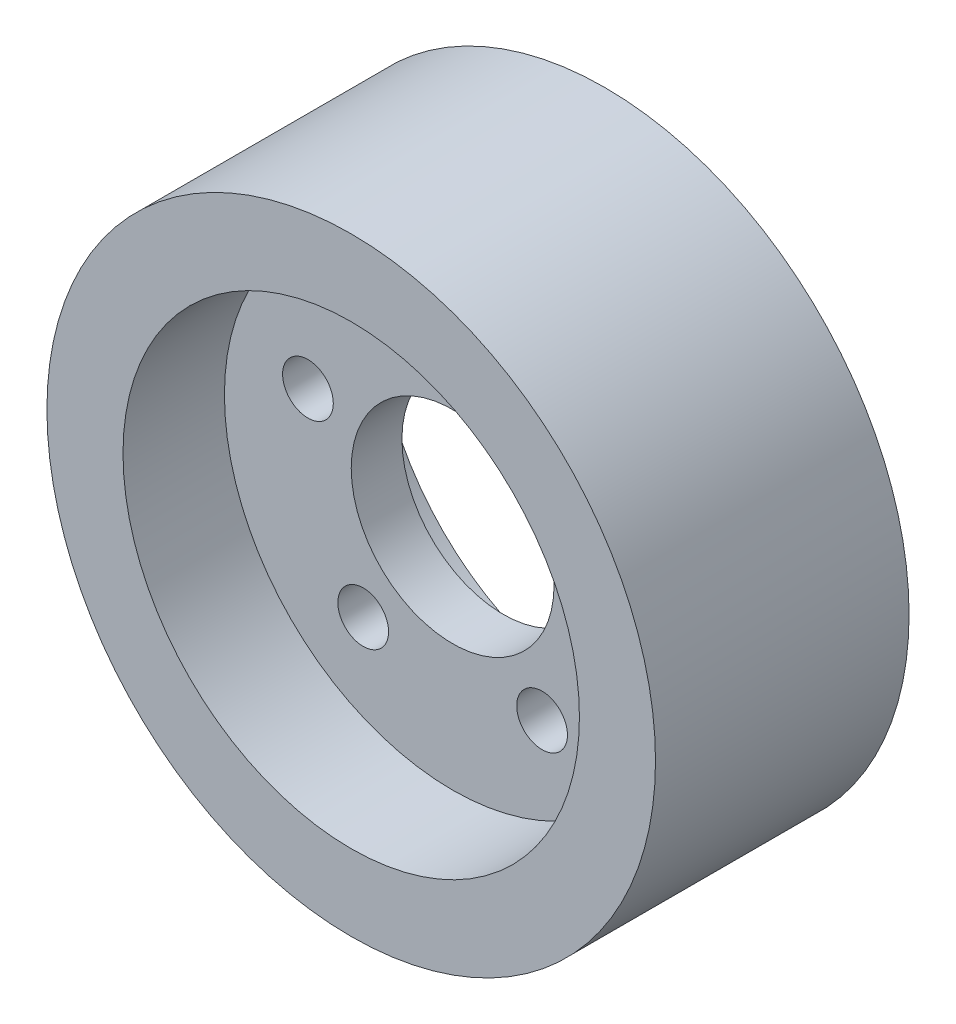
ISO-10303-21;
HEADER;
FILE_DESCRIPTION(('STEP AP214'),'2;1');
FILE_NAME('part.step','',(''),(''),'','','');
FILE_SCHEMA(('AUTOMOTIVE_DESIGN { 1 0 10303 214 1 1 1 1 }'));
ENDSEC;
DATA;
#1=APPLICATION_CONTEXT('core data for automotive mechanical design processes');
#2=APPLICATION_PROTOCOL_DEFINITION('international standard','automotive_design',2000,#1);
#3=PRODUCT_CONTEXT('',#1,'mechanical');
#4=PRODUCT('Part','Part','',(#3));
#5=PRODUCT_RELATED_PRODUCT_CATEGORY('part','',(#4));
#6=PRODUCT_DEFINITION_FORMATION('','',#4);
#7=PRODUCT_DEFINITION_CONTEXT('part definition',#1,'design');
#8=PRODUCT_DEFINITION('design','',#6,#7);
#9=PRODUCT_DEFINITION_SHAPE('','',#8);
#10=(LENGTH_UNIT() NAMED_UNIT(*) SI_UNIT(.MILLI.,.METRE.));
#11=(NAMED_UNIT(*) PLANE_ANGLE_UNIT() SI_UNIT($,.RADIAN.));
#12=(NAMED_UNIT(*) SI_UNIT($,.STERADIAN.) SOLID_ANGLE_UNIT());
#13=UNCERTAINTY_MEASURE_WITH_UNIT(LENGTH_MEASURE(1.E-05),#10,'distance_accuracy_value','');
#14=(GEOMETRIC_REPRESENTATION_CONTEXT(3) GLOBAL_UNCERTAINTY_ASSIGNED_CONTEXT((#13)) GLOBAL_UNIT_ASSIGNED_CONTEXT((#10,
#11,#12)) REPRESENTATION_CONTEXT('',''));
#15=CARTESIAN_POINT('',(0.,0.,0.));
#16=DIRECTION('',(0.,0.,1.));
#17=DIRECTION('',(1.,0.,0.));
#18=AXIS2_PLACEMENT_3D('',#15,#16,#17);
#19=CARTESIAN_POINT('',(0.,0.,12.5));
#20=DIRECTION('',(0.,0.,-1.));
#21=DIRECTION('',(-1.,0.,0.));
#22=AXIS2_PLACEMENT_3D('',#19,#20,#21);
#23=CYLINDRICAL_SURFACE('',#22,10.);
#24=CARTESIAN_POINT('',(0.,0.,-2.5));
#25=DIRECTION('',(0.,0.,-1.));
#26=DIRECTION('',(-1.,0.,0.));
#27=AXIS2_PLACEMENT_3D('',#24,#25,#26);
#28=CIRCLE('',#27,10.);
#29=CARTESIAN_POINT('',(-10.,0.,-2.5));
#30=VERTEX_POINT('',#29);
#31=EDGE_CURVE('E44',#30,#30,#28,.T.);
#32=ORIENTED_EDGE('',*,*,#31,.T.);
#33=EDGE_LOOP('',(#32));
#34=FACE_BOUND('',#33,.T.);
#35=CARTESIAN_POINT('',(0.,0.,2.5));
#36=DIRECTION('',(0.,0.,1.));
#37=DIRECTION('',(1.,0.,0.));
#38=AXIS2_PLACEMENT_3D('',#35,#36,#37);
#39=CIRCLE('',#38,10.);
#40=CARTESIAN_POINT('',(10.,0.,2.5));
#41=VERTEX_POINT('',#40);
#42=EDGE_CURVE('E53',#41,#41,#39,.T.);
#43=ORIENTED_EDGE('',*,*,#42,.T.);
#44=EDGE_LOOP('',(#43));
#45=FACE_BOUND('',#44,.T.);
#46=ADVANCED_FACE('F31',(#34,#45),#23,.F.);
#47=CARTESIAN_POINT('',(0.,0.,12.5));
#48=DIRECTION('',(0.,0.,1.));
#49=DIRECTION('',(1.,0.,0.));
#50=AXIS2_PLACEMENT_3D('',#47,#48,#49);
#51=PLANE('',#50);
#52=CARTESIAN_POINT('',(0.,0.,12.5));
#53=DIRECTION('',(0.,0.,-1.));
#54=DIRECTION('',(-1.,0.,0.));
#55=AXIS2_PLACEMENT_3D('',#52,#53,#54);
#56=CIRCLE('',#55,22.5);
#57=CARTESIAN_POINT('',(-22.5,0.,12.5));
#58=VERTEX_POINT('',#57);
#59=EDGE_CURVE('E60',#58,#58,#56,.T.);
#60=ORIENTED_EDGE('',*,*,#59,.T.);
#61=EDGE_LOOP('',(#60));
#62=FACE_BOUND('',#61,.T.);
#63=CARTESIAN_POINT('',(0.,0.,12.5));
#64=DIRECTION('',(0.,0.,1.));
#65=DIRECTION('',(1.,0.,0.));
#66=AXIS2_PLACEMENT_3D('',#63,#64,#65);
#67=CIRCLE('',#66,30.);
#68=CARTESIAN_POINT('',(30.,0.,12.5));
#69=VERTEX_POINT('',#68);
#70=EDGE_CURVE('E10',#69,#69,#67,.T.);
#71=ORIENTED_EDGE('',*,*,#70,.T.);
#72=EDGE_LOOP('',(#71));
#73=FACE_BOUND('',#72,.T.);
#74=ADVANCED_FACE('F97',(#62,#73),#51,.T.);
#75=CARTESIAN_POINT('',(0.,0.,-12.5));
#76=DIRECTION('',(0.,0.,1.));
#77=DIRECTION('',(1.,0.,0.));
#78=AXIS2_PLACEMENT_3D('',#75,#76,#77);
#79=PLANE('',#78);
#80=CARTESIAN_POINT('',(0.,0.,-12.5));
#81=DIRECTION('',(0.,0.,-1.));
#82=DIRECTION('',(-1.,0.,0.));
#83=AXIS2_PLACEMENT_3D('',#80,#81,#82);
#84=CIRCLE('',#83,22.5);
#85=CARTESIAN_POINT('',(-22.5,0.,-12.5));
#86=VERTEX_POINT('',#85);
#87=EDGE_CURVE('E47',#86,#86,#84,.T.);
#88=ORIENTED_EDGE('',*,*,#87,.F.);
#89=EDGE_LOOP('',(#88));
#90=FACE_BOUND('',#89,.T.);
#91=CARTESIAN_POINT('',(0.,0.,-12.5));
#92=DIRECTION('',(0.,0.,1.));
#93=DIRECTION('',(1.,0.,0.));
#94=AXIS2_PLACEMENT_3D('',#91,#92,#93);
#95=CIRCLE('',#94,30.);
#96=CARTESIAN_POINT('',(30.,0.,-12.5));
#97=VERTEX_POINT('',#96);
#98=EDGE_CURVE('E39',#97,#97,#95,.T.);
#99=ORIENTED_EDGE('',*,*,#98,.F.);
#100=EDGE_LOOP('',(#99));
#101=FACE_BOUND('',#100,.T.);
#102=ADVANCED_FACE('F94',(#90,#101),#79,.F.);
#103=CARTESIAN_POINT('',(0.,0.,12.5));
#104=DIRECTION('',(0.,0.,-1.));
#105=DIRECTION('',(-1.,0.,0.));
#106=AXIS2_PLACEMENT_3D('',#103,#104,#105);
#107=CYLINDRICAL_SURFACE('',#106,30.);
#108=ORIENTED_EDGE('',*,*,#70,.F.);
#109=EDGE_LOOP('',(#108));
#110=FACE_BOUND('',#109,.T.);
#111=ORIENTED_EDGE('',*,*,#98,.T.);
#112=EDGE_LOOP('',(#111));
#113=FACE_BOUND('',#112,.T.);
#114=ADVANCED_FACE('F33',(#110,#113),#107,.T.);
#115=CARTESIAN_POINT('',(0.,0.,-2.5));
#116=DIRECTION('',(0.,0.,-1.));
#117=DIRECTION('',(-1.,0.,0.));
#118=AXIS2_PLACEMENT_3D('',#115,#116,#117);
#119=CYLINDRICAL_SURFACE('',#118,22.5);
#120=CARTESIAN_POINT('',(0.,0.,-2.5));
#121=DIRECTION('',(0.,0.,-1.));
#122=DIRECTION('',(-1.,0.,0.));
#123=AXIS2_PLACEMENT_3D('',#120,#121,#122);
#124=CIRCLE('',#123,22.5);
#125=CARTESIAN_POINT('',(-22.5,0.,-2.5));
#126=VERTEX_POINT('',#125);
#127=EDGE_CURVE('E52',#126,#126,#124,.T.);
#128=ORIENTED_EDGE('',*,*,#127,.F.);
#129=EDGE_LOOP('',(#128));
#130=FACE_BOUND('',#129,.T.);
#131=ORIENTED_EDGE('',*,*,#87,.T.);
#132=EDGE_LOOP('',(#131));
#133=FACE_BOUND('',#132,.T.);
#134=ADVANCED_FACE('F92',(#130,#133),#119,.F.);
#135=CARTESIAN_POINT('',(0.,0.,-2.5));
#136=DIRECTION('',(0.,0.,-1.));
#137=DIRECTION('',(-1.,0.,0.));
#138=AXIS2_PLACEMENT_3D('',#135,#136,#137);
#139=PLANE('',#138);
#140=CARTESIAN_POINT('',(-14.2658477444273,4.63525491562417,-2.5));
#141=DIRECTION('',(0.,0.,-1.));
#142=DIRECTION('',(-0.309016994374945,-0.951056516295155,0.));
#143=AXIS2_PLACEMENT_3D('',#140,#141,#142);
#144=CIRCLE('',#143,2.5);
#145=CARTESIAN_POINT('',(-15.0383902303647,2.25761362488628,-2.5));
#146=VERTEX_POINT('',#145);
#147=EDGE_CURVE('E66',#146,#146,#144,.T.);
#148=ORIENTED_EDGE('',*,*,#147,.F.);
#149=EDGE_LOOP('',(#148));
#150=FACE_BOUND('',#149,.T.);
#151=CARTESIAN_POINT('',(-8.81677878438703,-12.1352549156243,-2.5));
#152=DIRECTION('',(0.,0.,-1.));
#153=DIRECTION('',(0.809016994374951,-0.587785252292469,0.));
#154=AXIS2_PLACEMENT_3D('',#151,#152,#153);
#155=CIRCLE('',#154,2.5);
#156=CARTESIAN_POINT('',(-6.79423629844965,-13.6047180463554,-2.5));
#157=VERTEX_POINT('',#156);
#158=EDGE_CURVE('E151',#157,#157,#155,.T.);
#159=ORIENTED_EDGE('',*,*,#158,.F.);
#160=EDGE_LOOP('',(#159));
#161=FACE_BOUND('',#160,.T.);
#162=CARTESIAN_POINT('',(8.8167787843872,-12.1352549156241,-2.5));
#163=DIRECTION('',(0.,0.,-1.));
#164=DIRECTION('',(0.809016994374942,0.58778525229248,0.));
#165=AXIS2_PLACEMENT_3D('',#162,#163,#164);
#166=CIRCLE('',#165,2.5);
#167=CARTESIAN_POINT('',(10.8393212703246,-10.6657917848929,-2.5));
#168=VERTEX_POINT('',#167);
#169=EDGE_CURVE('E154',#168,#168,#166,.T.);
#170=ORIENTED_EDGE('',*,*,#169,.F.);
#171=EDGE_LOOP('',(#170));
#172=FACE_BOUND('',#171,.T.);
#173=CARTESIAN_POINT('',(14.2658477444273,4.63525491562437,-2.5));
#174=DIRECTION('',(0.,0.,-1.));
#175=DIRECTION('',(-0.309016994374958,0.95105651629515,0.));
#176=AXIS2_PLACEMENT_3D('',#173,#174,#175);
#177=CIRCLE('',#176,2.5);
#178=CARTESIAN_POINT('',(13.4933052584899,7.01289620636225,-2.5));
#179=VERTEX_POINT('',#178);
#180=EDGE_CURVE('E81',#179,#179,#177,.T.);
#181=ORIENTED_EDGE('',*,*,#180,.F.);
#182=EDGE_LOOP('',(#181));
#183=FACE_BOUND('',#182,.T.);
#184=CARTESIAN_POINT('',(0.,15.,-2.5));
#185=DIRECTION('',(0.,0.,-1.));
#186=DIRECTION('',(-1.,0.,0.));
#187=AXIS2_PLACEMENT_3D('',#184,#185,#186);
#188=CIRCLE('',#187,2.5);
#189=CARTESIAN_POINT('',(-2.5,15.,-2.5));
#190=VERTEX_POINT('',#189);
#191=EDGE_CURVE('E61',#190,#190,#188,.T.);
#192=ORIENTED_EDGE('',*,*,#191,.F.);
#193=EDGE_LOOP('',(#192));
#194=FACE_BOUND('',#193,.T.);
#195=ORIENTED_EDGE('',*,*,#31,.F.);
#196=EDGE_LOOP('',(#195));
#197=FACE_BOUND('',#196,.T.);
#198=ORIENTED_EDGE('',*,*,#127,.T.);
#199=EDGE_LOOP('',(#198));
#200=FACE_BOUND('',#199,.T.);
#201=ADVANCED_FACE('F105',(#150,#161,#172,#183,#194,#197,#200),#139,.T.);
#202=CARTESIAN_POINT('',(0.,0.,2.5));
#203=DIRECTION('',(0.,0.,1.));
#204=DIRECTION('',(1.,0.,0.));
#205=AXIS2_PLACEMENT_3D('',#202,#203,#204);
#206=CYLINDRICAL_SURFACE('',#205,22.5);
#207=CARTESIAN_POINT('',(0.,0.,2.5));
#208=DIRECTION('',(0.,0.,-1.));
#209=DIRECTION('',(-1.,0.,0.));
#210=AXIS2_PLACEMENT_3D('',#207,#208,#209);
#211=CIRCLE('',#210,22.5);
#212=CARTESIAN_POINT('',(-22.5,0.,2.5));
#213=VERTEX_POINT('',#212);
#214=EDGE_CURVE('E56',#213,#213,#211,.T.);
#215=ORIENTED_EDGE('',*,*,#214,.T.);
#216=EDGE_LOOP('',(#215));
#217=FACE_BOUND('',#216,.T.);
#218=ORIENTED_EDGE('',*,*,#59,.F.);
#219=EDGE_LOOP('',(#218));
#220=FACE_BOUND('',#219,.T.);
#221=ADVANCED_FACE('F120',(#217,#220),#206,.F.);
#222=CARTESIAN_POINT('',(0.,0.,2.5));
#223=DIRECTION('',(0.,0.,1.));
#224=DIRECTION('',(-1.,0.,0.));
#225=AXIS2_PLACEMENT_3D('',#222,#223,#224);
#226=PLANE('',#225);
#227=CARTESIAN_POINT('',(-14.2658477444273,4.63525491562417,2.5));
#228=DIRECTION('',(0.,0.,1.));
#229=DIRECTION('',(1.,0.,0.));
#230=AXIS2_PLACEMENT_3D('',#227,#228,#229);
#231=CIRCLE('',#230,2.5);
#232=CARTESIAN_POINT('',(-11.7658477444273,4.63525491562417,2.5));
#233=VERTEX_POINT('',#232);
#234=EDGE_CURVE('E35',#233,#233,#231,.T.);
#235=ORIENTED_EDGE('',*,*,#234,.F.);
#236=EDGE_LOOP('',(#235));
#237=FACE_BOUND('',#236,.T.);
#238=CARTESIAN_POINT('',(-8.81677878438703,-12.1352549156243,2.5));
#239=DIRECTION('',(0.,0.,1.));
#240=DIRECTION('',(1.,0.,0.));
#241=AXIS2_PLACEMENT_3D('',#238,#239,#240);
#242=CIRCLE('',#241,2.5);
#243=CARTESIAN_POINT('',(-6.31677878438703,-12.1352549156243,2.5));
#244=VERTEX_POINT('',#243);
#245=EDGE_CURVE('E68',#244,#244,#242,.T.);
#246=ORIENTED_EDGE('',*,*,#245,.F.);
#247=EDGE_LOOP('',(#246));
#248=FACE_BOUND('',#247,.T.);
#249=CARTESIAN_POINT('',(8.8167787843872,-12.1352549156241,2.5));
#250=DIRECTION('',(0.,0.,1.));
#251=DIRECTION('',(1.,0.,0.));
#252=AXIS2_PLACEMENT_3D('',#249,#250,#251);
#253=CIRCLE('',#252,2.5);
#254=CARTESIAN_POINT('',(11.3167787843872,-12.1352549156241,2.5));
#255=VERTEX_POINT('',#254);
#256=EDGE_CURVE('E65',#255,#255,#253,.T.);
#257=ORIENTED_EDGE('',*,*,#256,.F.);
#258=EDGE_LOOP('',(#257));
#259=FACE_BOUND('',#258,.T.);
#260=CARTESIAN_POINT('',(14.2658477444273,4.63525491562437,2.5));
#261=DIRECTION('',(0.,0.,1.));
#262=DIRECTION('',(1.,0.,0.));
#263=AXIS2_PLACEMENT_3D('',#260,#261,#262);
#264=CIRCLE('',#263,2.5);
#265=CARTESIAN_POINT('',(16.7658477444272,4.63525491562437,2.5));
#266=VERTEX_POINT('',#265);
#267=EDGE_CURVE('E62',#266,#266,#264,.T.);
#268=ORIENTED_EDGE('',*,*,#267,.F.);
#269=EDGE_LOOP('',(#268));
#270=FACE_BOUND('',#269,.T.);
#271=CARTESIAN_POINT('',(0.,15.,2.5));
#272=DIRECTION('',(0.,0.,1.));
#273=DIRECTION('',(1.,0.,0.));
#274=AXIS2_PLACEMENT_3D('',#271,#272,#273);
#275=CIRCLE('',#274,2.5);
#276=CARTESIAN_POINT('',(2.5,15.,2.5));
#277=VERTEX_POINT('',#276);
#278=EDGE_CURVE('E57',#277,#277,#275,.T.);
#279=ORIENTED_EDGE('',*,*,#278,.F.);
#280=EDGE_LOOP('',(#279));
#281=FACE_BOUND('',#280,.T.);
#282=ORIENTED_EDGE('',*,*,#42,.F.);
#283=EDGE_LOOP('',(#282));
#284=FACE_BOUND('',#283,.T.);
#285=ORIENTED_EDGE('',*,*,#214,.F.);
#286=EDGE_LOOP('',(#285));
#287=FACE_BOUND('',#286,.T.);
#288=ADVANCED_FACE('F124',(#237,#248,#259,#270,#281,#284,#287),#226,.T.);
#289=CARTESIAN_POINT('',(0.,15.,12.5));
#290=DIRECTION('',(0.,0.,-1.));
#291=DIRECTION('',(-1.,0.,0.));
#292=AXIS2_PLACEMENT_3D('',#289,#290,#291);
#293=CYLINDRICAL_SURFACE('',#292,2.5);
#294=ORIENTED_EDGE('',*,*,#278,.T.);
#295=EDGE_LOOP('',(#294));
#296=FACE_BOUND('',#295,.T.);
#297=ORIENTED_EDGE('',*,*,#191,.T.);
#298=EDGE_LOOP('',(#297));
#299=FACE_BOUND('',#298,.T.);
#300=ADVANCED_FACE('F128',(#296,#299),#293,.F.);
#301=CARTESIAN_POINT('',(14.2658477444273,4.63525491562437,12.5));
#302=DIRECTION('',(0.,0.,-1.));
#303=DIRECTION('',(-1.,0.,0.));
#304=AXIS2_PLACEMENT_3D('',#301,#302,#303);
#305=CYLINDRICAL_SURFACE('',#304,2.5);
#306=ORIENTED_EDGE('',*,*,#267,.T.);
#307=EDGE_LOOP('',(#306));
#308=FACE_BOUND('',#307,.T.);
#309=ORIENTED_EDGE('',*,*,#180,.T.);
#310=EDGE_LOOP('',(#309));
#311=FACE_BOUND('',#310,.T.);
#312=ADVANCED_FACE('F132',(#308,#311),#305,.F.);
#313=CARTESIAN_POINT('',(8.8167787843872,-12.1352549156241,12.5));
#314=DIRECTION('',(0.,0.,-1.));
#315=DIRECTION('',(-1.,0.,0.));
#316=AXIS2_PLACEMENT_3D('',#313,#314,#315);
#317=CYLINDRICAL_SURFACE('',#316,2.5);
#318=ORIENTED_EDGE('',*,*,#256,.T.);
#319=EDGE_LOOP('',(#318));
#320=FACE_BOUND('',#319,.T.);
#321=ORIENTED_EDGE('',*,*,#169,.T.);
#322=EDGE_LOOP('',(#321));
#323=FACE_BOUND('',#322,.T.);
#324=ADVANCED_FACE('F136',(#320,#323),#317,.F.);
#325=CARTESIAN_POINT('',(-8.81677878438703,-12.1352549156243,12.5));
#326=DIRECTION('',(0.,0.,-1.));
#327=DIRECTION('',(-1.,0.,0.));
#328=AXIS2_PLACEMENT_3D('',#325,#326,#327);
#329=CYLINDRICAL_SURFACE('',#328,2.5);
#330=ORIENTED_EDGE('',*,*,#245,.T.);
#331=EDGE_LOOP('',(#330));
#332=FACE_BOUND('',#331,.T.);
#333=ORIENTED_EDGE('',*,*,#158,.T.);
#334=EDGE_LOOP('',(#333));
#335=FACE_BOUND('',#334,.T.);
#336=ADVANCED_FACE('F140',(#332,#335),#329,.F.);
#337=CARTESIAN_POINT('',(-14.2658477444273,4.63525491562417,12.5));
#338=DIRECTION('',(0.,0.,-1.));
#339=DIRECTION('',(-1.,0.,0.));
#340=AXIS2_PLACEMENT_3D('',#337,#338,#339);
#341=CYLINDRICAL_SURFACE('',#340,2.5);
#342=ORIENTED_EDGE('',*,*,#234,.T.);
#343=EDGE_LOOP('',(#342));
#344=FACE_BOUND('',#343,.T.);
#345=ORIENTED_EDGE('',*,*,#147,.T.);
#346=EDGE_LOOP('',(#345));
#347=FACE_BOUND('',#346,.T.);
#348=ADVANCED_FACE('F144',(#344,#347),#341,.F.);
#349=CLOSED_SHELL('',(#46,#74,#102,#114,#134,#201,#221,#288,#300,#312,#324,#336,#348));
#350=MANIFOLD_SOLID_BREP('B2',#349);
#351=ADVANCED_BREP_SHAPE_REPRESENTATION('',(#18,#350),#14);
#352=SHAPE_DEFINITION_REPRESENTATION(#9,#351);
ENDSEC;
END-ISO-10303-21;
